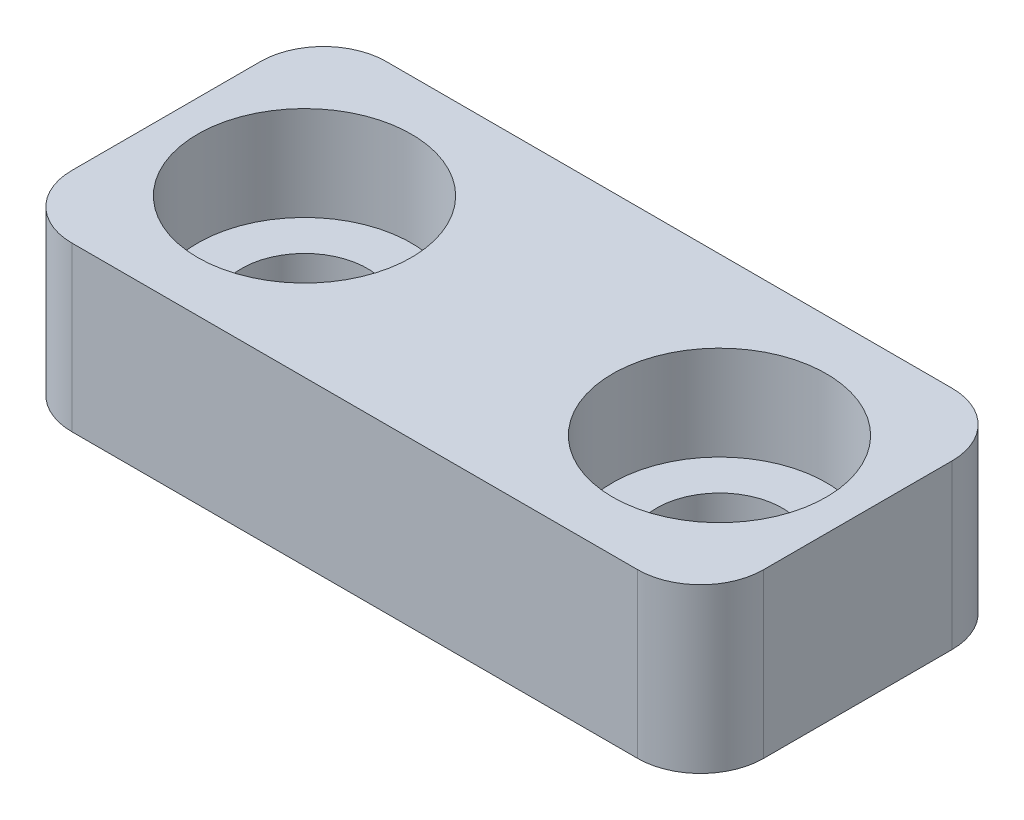
ISO-10303-21;
HEADER;
FILE_DESCRIPTION(('STEP AP214'),'2;1');
FILE_NAME('part.step','',(''),(''),'','','');
FILE_SCHEMA(('AUTOMOTIVE_DESIGN { 1 0 10303 214 1 1 1 1 }'));
ENDSEC;
DATA;
#1=APPLICATION_CONTEXT('core data for automotive mechanical design processes');
#2=APPLICATION_PROTOCOL_DEFINITION('international standard','automotive_design',2000,#1);
#3=PRODUCT_CONTEXT('',#1,'mechanical');
#4=PRODUCT('Part','Part','',(#3));
#5=PRODUCT_RELATED_PRODUCT_CATEGORY('part','',(#4));
#6=PRODUCT_DEFINITION_FORMATION('','',#4);
#7=PRODUCT_DEFINITION_CONTEXT('part definition',#1,'design');
#8=PRODUCT_DEFINITION('design','',#6,#7);
#9=PRODUCT_DEFINITION_SHAPE('','',#8);
#10=(LENGTH_UNIT() NAMED_UNIT(*) SI_UNIT(.MILLI.,.METRE.));
#11=(NAMED_UNIT(*) PLANE_ANGLE_UNIT() SI_UNIT($,.RADIAN.));
#12=(NAMED_UNIT(*) SI_UNIT($,.STERADIAN.) SOLID_ANGLE_UNIT());
#13=UNCERTAINTY_MEASURE_WITH_UNIT(LENGTH_MEASURE(1.E-05),#10,'distance_accuracy_value','');
#14=(GEOMETRIC_REPRESENTATION_CONTEXT(3) GLOBAL_UNCERTAINTY_ASSIGNED_CONTEXT((#13)) GLOBAL_UNIT_ASSIGNED_CONTEXT((#10,
#11,#12)) REPRESENTATION_CONTEXT('',''));
#15=CARTESIAN_POINT('',(0.,0.,0.));
#16=DIRECTION('',(0.,0.,1.));
#17=DIRECTION('',(1.,0.,0.));
#18=AXIS2_PLACEMENT_3D('',#15,#16,#17);
#19=CARTESIAN_POINT('',(3.30000000000001,2.6,0.));
#20=DIRECTION('',(0.,-1.,0.));
#21=DIRECTION('',(0.,0.,-1.));
#22=AXIS2_PLACEMENT_3D('',#19,#20,#21);
#23=CYLINDRICAL_SURFACE('',#22,0.999999999999999);
#24=CARTESIAN_POINT('',(3.30000000000001,0.,0.));
#25=DIRECTION('',(0.,1.,0.));
#26=DIRECTION('',(0.,0.,1.));
#27=AXIS2_PLACEMENT_3D('',#24,#25,#26);
#28=CIRCLE('',#27,0.999999999999999);
#29=CARTESIAN_POINT('',(3.30000000000001,0.,0.999999999999999));
#30=VERTEX_POINT('',#29);
#31=EDGE_CURVE('E137',#30,#30,#28,.T.);
#32=ORIENTED_EDGE('',*,*,#31,.F.);
#33=EDGE_LOOP('',(#32));
#34=FACE_BOUND('',#33,.T.);
#35=CARTESIAN_POINT('',(3.30000000000001,1.1,0.));
#36=DIRECTION('',(0.,1.,0.));
#37=DIRECTION('',(0.,0.,1.));
#38=AXIS2_PLACEMENT_3D('',#35,#36,#37);
#39=CIRCLE('',#38,0.999999999999999);
#40=CARTESIAN_POINT('',(3.30000000000001,1.1,0.999999999999999));
#41=VERTEX_POINT('',#40);
#42=EDGE_CURVE('E150',#41,#41,#39,.T.);
#43=ORIENTED_EDGE('',*,*,#42,.T.);
#44=EDGE_LOOP('',(#43));
#45=FACE_BOUND('',#44,.T.);
#46=ADVANCED_FACE('F37',(#34,#45),#23,.F.);
#47=CARTESIAN_POINT('',(-3.29999999999999,2.6,0.));
#48=DIRECTION('',(0.,-1.,0.));
#49=DIRECTION('',(0.,0.,-1.));
#50=AXIS2_PLACEMENT_3D('',#47,#48,#49);
#51=CYLINDRICAL_SURFACE('',#50,1.);
#52=CARTESIAN_POINT('',(-3.29999999999999,0.,0.));
#53=DIRECTION('',(0.,1.,0.));
#54=DIRECTION('',(0.,0.,1.));
#55=AXIS2_PLACEMENT_3D('',#52,#53,#54);
#56=CIRCLE('',#55,1.);
#57=CARTESIAN_POINT('',(-3.29999999999999,0.,1.));
#58=VERTEX_POINT('',#57);
#59=EDGE_CURVE('E131',#58,#58,#56,.T.);
#60=ORIENTED_EDGE('',*,*,#59,.F.);
#61=EDGE_LOOP('',(#60));
#62=FACE_BOUND('',#61,.T.);
#63=CARTESIAN_POINT('',(-3.29999999999999,1.1,0.));
#64=DIRECTION('',(0.,1.,0.));
#65=DIRECTION('',(0.,0.,1.));
#66=AXIS2_PLACEMENT_3D('',#63,#64,#65);
#67=CIRCLE('',#66,1.);
#68=CARTESIAN_POINT('',(-3.29999999999999,1.1,1.));
#69=VERTEX_POINT('',#68);
#70=EDGE_CURVE('E146',#69,#69,#67,.T.);
#71=ORIENTED_EDGE('',*,*,#70,.T.);
#72=EDGE_LOOP('',(#71));
#73=FACE_BOUND('',#72,.T.);
#74=ADVANCED_FACE('F217',(#62,#73),#51,.F.);
#75=CARTESIAN_POINT('',(0.,2.6,0.));
#76=DIRECTION('',(0.,-1.,0.));
#77=DIRECTION('',(0.,0.,-1.));
#78=AXIS2_PLACEMENT_3D('',#75,#76,#77);
#79=PLANE('',#78);
#80=CARTESIAN_POINT('',(3.30000000000001,2.6,0.));
#81=DIRECTION('',(0.,1.,0.));
#82=DIRECTION('',(0.,0.,1.));
#83=AXIS2_PLACEMENT_3D('',#80,#81,#82);
#84=CIRCLE('',#83,1.7);
#85=CARTESIAN_POINT('',(3.30000000000001,2.6,1.7));
#86=VERTEX_POINT('',#85);
#87=EDGE_CURVE('E199',#86,#86,#84,.T.);
#88=ORIENTED_EDGE('',*,*,#87,.F.);
#89=EDGE_LOOP('',(#88));
#90=FACE_BOUND('',#89,.T.);
#91=CARTESIAN_POINT('',(-3.29999999999999,2.6,0.));
#92=DIRECTION('',(0.,1.,0.));
#93=DIRECTION('',(0.,0.,1.));
#94=AXIS2_PLACEMENT_3D('',#91,#92,#93);
#95=CIRCLE('',#94,1.7);
#96=CARTESIAN_POINT('',(-3.29999999999999,2.6,1.7));
#97=VERTEX_POINT('',#96);
#98=EDGE_CURVE('E153',#97,#97,#95,.T.);
#99=ORIENTED_EDGE('',*,*,#98,.F.);
#100=EDGE_LOOP('',(#99));
#101=FACE_BOUND('',#100,.T.);
#102=DIRECTION('',(1.,0.,0.));
#103=VECTOR('',#102,1.);
#104=CARTESIAN_POINT('',(-5.49999999999999,2.6,2.50000000000001));
#105=LINE('',#104,#103);
#106=CARTESIAN_POINT('',(-4.49999999999999,2.6,2.50000000000001));
#107=VERTEX_POINT('',#106);
#108=CARTESIAN_POINT('',(4.50000000000001,2.6,2.50000000000001));
#109=VERTEX_POINT('',#108);
#110=EDGE_CURVE('E140',#107,#109,#105,.T.);
#111=ORIENTED_EDGE('',*,*,#110,.T.);
#112=CARTESIAN_POINT('',(4.50000000000001,2.6,1.50000000000001));
#113=DIRECTION('',(0.,-1.,0.));
#114=DIRECTION('',(0.,0.,-1.));
#115=AXIS2_PLACEMENT_3D('',#112,#113,#114);
#116=CIRCLE('',#115,1.);
#117=CARTESIAN_POINT('',(5.50000000000001,2.6,1.50000000000001));
#118=VERTEX_POINT('',#117);
#119=EDGE_CURVE('E168',#109,#118,#116,.F.);
#120=ORIENTED_EDGE('',*,*,#119,.T.);
#121=DIRECTION('',(0.,0.,-1.));
#122=VECTOR('',#121,1.);
#123=CARTESIAN_POINT('',(5.50000000000001,2.6,2.50000000000001));
#124=LINE('',#123,#122);
#125=CARTESIAN_POINT('',(5.50000000000001,2.6,-1.5));
#126=VERTEX_POINT('',#125);
#127=EDGE_CURVE('E123',#118,#126,#124,.T.);
#128=ORIENTED_EDGE('',*,*,#127,.T.);
#129=CARTESIAN_POINT('',(4.50000000000001,2.6,-1.5));
#130=DIRECTION('',(0.,-1.,0.));
#131=DIRECTION('',(0.,0.,-1.));
#132=AXIS2_PLACEMENT_3D('',#129,#130,#131);
#133=CIRCLE('',#132,1.);
#134=CARTESIAN_POINT('',(4.50000000000001,2.6,-2.5));
#135=VERTEX_POINT('',#134);
#136=EDGE_CURVE('E166',#126,#135,#133,.F.);
#137=ORIENTED_EDGE('',*,*,#136,.T.);
#138=DIRECTION('',(-1.,0.,0.));
#139=VECTOR('',#138,1.);
#140=CARTESIAN_POINT('',(-5.49999999999999,2.6,-2.5));
#141=LINE('',#140,#139);
#142=CARTESIAN_POINT('',(-4.49999999999999,2.6,-2.5));
#143=VERTEX_POINT('',#142);
#144=EDGE_CURVE('E179',#135,#143,#141,.T.);
#145=ORIENTED_EDGE('',*,*,#144,.T.);
#146=CARTESIAN_POINT('',(-4.49999999999999,2.6,-1.5));
#147=DIRECTION('',(0.,-1.,0.));
#148=DIRECTION('',(0.,0.,-1.));
#149=AXIS2_PLACEMENT_3D('',#146,#147,#148);
#150=CIRCLE('',#149,1.);
#151=CARTESIAN_POINT('',(-5.49999999999999,2.6,-1.5));
#152=VERTEX_POINT('',#151);
#153=EDGE_CURVE('E58',#143,#152,#150,.F.);
#154=ORIENTED_EDGE('',*,*,#153,.T.);
#155=DIRECTION('',(0.,0.,1.));
#156=VECTOR('',#155,1.);
#157=CARTESIAN_POINT('',(-5.49999999999999,2.6,2.50000000000001));
#158=LINE('',#157,#156);
#159=CARTESIAN_POINT('',(-5.49999999999999,2.6,1.50000000000001));
#160=VERTEX_POINT('',#159);
#161=EDGE_CURVE('E187',#152,#160,#158,.T.);
#162=ORIENTED_EDGE('',*,*,#161,.T.);
#163=CARTESIAN_POINT('',(-4.49999999999999,2.6,1.50000000000001));
#164=DIRECTION('',(0.,-1.,0.));
#165=DIRECTION('',(0.,0.,-1.));
#166=AXIS2_PLACEMENT_3D('',#163,#164,#165);
#167=CIRCLE('',#166,1.);
#168=EDGE_CURVE('E163',#160,#107,#167,.F.);
#169=ORIENTED_EDGE('',*,*,#168,.T.);
#170=EDGE_LOOP('',(#111,#120,#128,#137,#145,#154,#162,#169));
#171=FACE_BOUND('',#170,.T.);
#172=ADVANCED_FACE('F214',(#90,#101,#171),#79,.F.);
#173=CARTESIAN_POINT('',(0.,0.,0.));
#174=DIRECTION('',(0.,-1.,0.));
#175=DIRECTION('',(0.,0.,-1.));
#176=AXIS2_PLACEMENT_3D('',#173,#174,#175);
#177=PLANE('',#176);
#178=ORIENTED_EDGE('',*,*,#59,.T.);
#179=EDGE_LOOP('',(#178));
#180=FACE_BOUND('',#179,.T.);
#181=DIRECTION('',(0.,0.,-1.));
#182=VECTOR('',#181,1.);
#183=CARTESIAN_POINT('',(5.50000000000001,0.,2.50000000000001));
#184=LINE('',#183,#182);
#185=CARTESIAN_POINT('',(5.50000000000001,0.,1.50000000000001));
#186=VERTEX_POINT('',#185);
#187=CARTESIAN_POINT('',(5.50000000000001,0.,-1.5));
#188=VERTEX_POINT('',#187);
#189=EDGE_CURVE('E120',#186,#188,#184,.T.);
#190=ORIENTED_EDGE('',*,*,#189,.F.);
#191=CARTESIAN_POINT('',(4.50000000000001,0.,1.50000000000001));
#192=DIRECTION('',(0.,-1.,0.));
#193=DIRECTION('',(0.,0.,-1.));
#194=AXIS2_PLACEMENT_3D('',#191,#192,#193);
#195=CIRCLE('',#194,1.);
#196=CARTESIAN_POINT('',(4.50000000000001,0.,2.50000000000001));
#197=VERTEX_POINT('',#196);
#198=EDGE_CURVE('E103',#186,#197,#195,.T.);
#199=ORIENTED_EDGE('',*,*,#198,.T.);
#200=DIRECTION('',(1.,0.,0.));
#201=VECTOR('',#200,1.);
#202=CARTESIAN_POINT('',(-5.49999999999999,0.,2.50000000000001));
#203=LINE('',#202,#201);
#204=CARTESIAN_POINT('',(-4.49999999999999,0.,2.50000000000001));
#205=VERTEX_POINT('',#204);
#206=EDGE_CURVE('E144',#205,#197,#203,.T.);
#207=ORIENTED_EDGE('',*,*,#206,.F.);
#208=CARTESIAN_POINT('',(-4.49999999999999,0.,1.50000000000001));
#209=DIRECTION('',(0.,-1.,0.));
#210=DIRECTION('',(0.,0.,-1.));
#211=AXIS2_PLACEMENT_3D('',#208,#209,#210);
#212=CIRCLE('',#211,1.);
#213=CARTESIAN_POINT('',(-5.49999999999999,0.,1.50000000000001));
#214=VERTEX_POINT('',#213);
#215=EDGE_CURVE('E124',#205,#214,#212,.T.);
#216=ORIENTED_EDGE('',*,*,#215,.T.);
#217=DIRECTION('',(0.,0.,1.));
#218=VECTOR('',#217,1.);
#219=CARTESIAN_POINT('',(-5.49999999999999,0.,2.50000000000001));
#220=LINE('',#219,#218);
#221=CARTESIAN_POINT('',(-5.49999999999999,0.,-1.5));
#222=VERTEX_POINT('',#221);
#223=EDGE_CURVE('E134',#222,#214,#220,.T.);
#224=ORIENTED_EDGE('',*,*,#223,.F.);
#225=CARTESIAN_POINT('',(-4.49999999999999,0.,-1.5));
#226=DIRECTION('',(0.,-1.,0.));
#227=DIRECTION('',(0.,0.,-1.));
#228=AXIS2_PLACEMENT_3D('',#225,#226,#227);
#229=CIRCLE('',#228,1.);
#230=CARTESIAN_POINT('',(-4.49999999999999,0.,-2.5));
#231=VERTEX_POINT('',#230);
#232=EDGE_CURVE('E157',#222,#231,#229,.T.);
#233=ORIENTED_EDGE('',*,*,#232,.T.);
#234=DIRECTION('',(-1.,0.,0.));
#235=VECTOR('',#234,1.);
#236=CARTESIAN_POINT('',(-5.49999999999999,0.,-2.5));
#237=LINE('',#236,#235);
#238=CARTESIAN_POINT('',(4.50000000000001,0.,-2.5));
#239=VERTEX_POINT('',#238);
#240=EDGE_CURVE('E130',#239,#231,#237,.T.);
#241=ORIENTED_EDGE('',*,*,#240,.F.);
#242=CARTESIAN_POINT('',(4.50000000000001,0.,-1.5));
#243=DIRECTION('',(0.,-1.,0.));
#244=DIRECTION('',(0.,0.,-1.));
#245=AXIS2_PLACEMENT_3D('',#242,#243,#244);
#246=CIRCLE('',#245,1.);
#247=EDGE_CURVE('E114',#239,#188,#246,.T.);
#248=ORIENTED_EDGE('',*,*,#247,.T.);
#249=EDGE_LOOP('',(#190,#199,#207,#216,#224,#233,#241,#248));
#250=FACE_BOUND('',#249,.T.);
#251=ORIENTED_EDGE('',*,*,#31,.T.);
#252=EDGE_LOOP('',(#251));
#253=FACE_BOUND('',#252,.T.);
#254=ADVANCED_FACE('F127',(#180,#250,#253),#177,.T.);
#255=CARTESIAN_POINT('',(5.50000000000001,2.6,2.50000000000001));
#256=DIRECTION('',(-1.,0.,0.));
#257=DIRECTION('',(0.,0.,1.));
#258=AXIS2_PLACEMENT_3D('',#255,#256,#257);
#259=PLANE('',#258);
#260=ORIENTED_EDGE('',*,*,#127,.F.);
#261=DIRECTION('',(0.,-1.,0.));
#262=VECTOR('',#261,1.);
#263=CARTESIAN_POINT('',(5.50000000000001,2.6,1.50000000000001));
#264=LINE('',#263,#262);
#265=EDGE_CURVE('E107',#118,#186,#264,.T.);
#266=ORIENTED_EDGE('',*,*,#265,.T.);
#267=ORIENTED_EDGE('',*,*,#189,.T.);
#268=DIRECTION('',(0.,-1.,0.));
#269=VECTOR('',#268,1.);
#270=CARTESIAN_POINT('',(5.50000000000001,2.6,-1.5));
#271=LINE('',#270,#269);
#272=EDGE_CURVE('E125',#188,#126,#271,.F.);
#273=ORIENTED_EDGE('',*,*,#272,.T.);
#274=EDGE_LOOP('',(#260,#266,#267,#273));
#275=FACE_BOUND('',#274,.T.);
#276=ADVANCED_FACE('F119',(#275),#259,.F.);
#277=CARTESIAN_POINT('',(-5.49999999999999,2.6,-2.5));
#278=DIRECTION('',(0.,0.,1.));
#279=DIRECTION('',(1.,0.,0.));
#280=AXIS2_PLACEMENT_3D('',#277,#278,#279);
#281=PLANE('',#280);
#282=ORIENTED_EDGE('',*,*,#144,.F.);
#283=DIRECTION('',(0.,-1.,0.));
#284=VECTOR('',#283,1.);
#285=CARTESIAN_POINT('',(4.50000000000001,2.6,-2.5));
#286=LINE('',#285,#284);
#287=EDGE_CURVE('E172',#135,#239,#286,.T.);
#288=ORIENTED_EDGE('',*,*,#287,.T.);
#289=ORIENTED_EDGE('',*,*,#240,.T.);
#290=DIRECTION('',(0.,-1.,0.));
#291=VECTOR('',#290,1.);
#292=CARTESIAN_POINT('',(-4.49999999999999,2.6,-2.5));
#293=LINE('',#292,#291);
#294=EDGE_CURVE('E170',#231,#143,#293,.F.);
#295=ORIENTED_EDGE('',*,*,#294,.T.);
#296=EDGE_LOOP('',(#282,#288,#289,#295));
#297=FACE_BOUND('',#296,.T.);
#298=ADVANCED_FACE('F177',(#297),#281,.F.);
#299=CARTESIAN_POINT('',(-5.49999999999999,2.6,2.50000000000001));
#300=DIRECTION('',(1.,0.,0.));
#301=DIRECTION('',(0.,0.,-1.));
#302=AXIS2_PLACEMENT_3D('',#299,#300,#301);
#303=PLANE('',#302);
#304=ORIENTED_EDGE('',*,*,#161,.F.);
#305=DIRECTION('',(0.,-1.,0.));
#306=VECTOR('',#305,1.);
#307=CARTESIAN_POINT('',(-5.49999999999999,2.6,-1.5));
#308=LINE('',#307,#306);
#309=EDGE_CURVE('E11',#152,#222,#308,.T.);
#310=ORIENTED_EDGE('',*,*,#309,.T.);
#311=ORIENTED_EDGE('',*,*,#223,.T.);
#312=DIRECTION('',(0.,-1.,0.));
#313=VECTOR('',#312,1.);
#314=CARTESIAN_POINT('',(-5.49999999999999,2.6,1.50000000000001));
#315=LINE('',#314,#313);
#316=EDGE_CURVE('E45',#214,#160,#315,.F.);
#317=ORIENTED_EDGE('',*,*,#316,.T.);
#318=EDGE_LOOP('',(#304,#310,#311,#317));
#319=FACE_BOUND('',#318,.T.);
#320=ADVANCED_FACE('F186',(#319),#303,.F.);
#321=CARTESIAN_POINT('',(-5.49999999999999,2.6,2.50000000000001));
#322=DIRECTION('',(0.,0.,-1.));
#323=DIRECTION('',(-1.,0.,0.));
#324=AXIS2_PLACEMENT_3D('',#321,#322,#323);
#325=PLANE('',#324);
#326=ORIENTED_EDGE('',*,*,#206,.T.);
#327=DIRECTION('',(0.,-1.,0.));
#328=VECTOR('',#327,1.);
#329=CARTESIAN_POINT('',(4.50000000000001,2.6,2.50000000000001));
#330=LINE('',#329,#328);
#331=EDGE_CURVE('E108',#197,#109,#330,.F.);
#332=ORIENTED_EDGE('',*,*,#331,.T.);
#333=ORIENTED_EDGE('',*,*,#110,.F.);
#334=DIRECTION('',(0.,-1.,0.));
#335=VECTOR('',#334,1.);
#336=CARTESIAN_POINT('',(-4.49999999999999,2.6,2.50000000000001));
#337=LINE('',#336,#335);
#338=EDGE_CURVE('E113',#107,#205,#337,.T.);
#339=ORIENTED_EDGE('',*,*,#338,.T.);
#340=EDGE_LOOP('',(#326,#332,#333,#339));
#341=FACE_BOUND('',#340,.T.);
#342=ADVANCED_FACE('F223',(#341),#325,.F.);
#343=CARTESIAN_POINT('',(-3.29999999999999,1.1,0.));
#344=DIRECTION('',(0.,1.,0.));
#345=DIRECTION('',(0.,0.,1.));
#346=AXIS2_PLACEMENT_3D('',#343,#344,#345);
#347=CYLINDRICAL_SURFACE('',#346,1.7);
#348=CARTESIAN_POINT('',(-3.29999999999999,1.1,0.));
#349=DIRECTION('',(0.,1.,0.));
#350=DIRECTION('',(0.,0.,1.));
#351=AXIS2_PLACEMENT_3D('',#348,#349,#350);
#352=CIRCLE('',#351,1.7);
#353=CARTESIAN_POINT('',(-3.29999999999999,1.1,1.7));
#354=VERTEX_POINT('',#353);
#355=EDGE_CURVE('E149',#354,#354,#352,.T.);
#356=ORIENTED_EDGE('',*,*,#355,.F.);
#357=EDGE_LOOP('',(#356));
#358=FACE_BOUND('',#357,.T.);
#359=ORIENTED_EDGE('',*,*,#98,.T.);
#360=EDGE_LOOP('',(#359));
#361=FACE_BOUND('',#360,.T.);
#362=ADVANCED_FACE('F241',(#358,#361),#347,.F.);
#363=CARTESIAN_POINT('',(-3.29999999999999,1.1,0.));
#364=DIRECTION('',(0.,1.,0.));
#365=DIRECTION('',(0.,0.,1.));
#366=AXIS2_PLACEMENT_3D('',#363,#364,#365);
#367=PLANE('',#366);
#368=ORIENTED_EDGE('',*,*,#70,.F.);
#369=EDGE_LOOP('',(#368));
#370=FACE_BOUND('',#369,.T.);
#371=ORIENTED_EDGE('',*,*,#355,.T.);
#372=EDGE_LOOP('',(#371));
#373=FACE_BOUND('',#372,.T.);
#374=ADVANCED_FACE('F210',(#370,#373),#367,.T.);
#375=CARTESIAN_POINT('',(3.30000000000001,1.1,0.));
#376=DIRECTION('',(0.,1.,0.));
#377=DIRECTION('',(0.,0.,1.));
#378=AXIS2_PLACEMENT_3D('',#375,#376,#377);
#379=CYLINDRICAL_SURFACE('',#378,1.7);
#380=CARTESIAN_POINT('',(3.30000000000001,1.1,0.));
#381=DIRECTION('',(0.,1.,0.));
#382=DIRECTION('',(0.,0.,1.));
#383=AXIS2_PLACEMENT_3D('',#380,#381,#382);
#384=CIRCLE('',#383,1.7);
#385=CARTESIAN_POINT('',(3.30000000000001,1.1,1.7));
#386=VERTEX_POINT('',#385);
#387=EDGE_CURVE('E154',#386,#386,#384,.T.);
#388=ORIENTED_EDGE('',*,*,#387,.F.);
#389=EDGE_LOOP('',(#388));
#390=FACE_BOUND('',#389,.T.);
#391=ORIENTED_EDGE('',*,*,#87,.T.);
#392=EDGE_LOOP('',(#391));
#393=FACE_BOUND('',#392,.T.);
#394=ADVANCED_FACE('F207',(#390,#393),#379,.F.);
#395=CARTESIAN_POINT('',(3.30000000000001,1.1,0.));
#396=DIRECTION('',(0.,1.,0.));
#397=DIRECTION('',(0.,0.,1.));
#398=AXIS2_PLACEMENT_3D('',#395,#396,#397);
#399=PLANE('',#398);
#400=ORIENTED_EDGE('',*,*,#42,.F.);
#401=EDGE_LOOP('',(#400));
#402=FACE_BOUND('',#401,.T.);
#403=ORIENTED_EDGE('',*,*,#387,.T.);
#404=EDGE_LOOP('',(#403));
#405=FACE_BOUND('',#404,.T.);
#406=ADVANCED_FACE('F205',(#402,#405),#399,.T.);
#407=CARTESIAN_POINT('',(4.50000000000001,2.6,1.50000000000001));
#408=DIRECTION('',(0.,-1.,0.));
#409=DIRECTION('',(0.,0.,-1.));
#410=AXIS2_PLACEMENT_3D('',#407,#408,#409);
#411=CYLINDRICAL_SURFACE('',#410,1.);
#412=ORIENTED_EDGE('',*,*,#119,.F.);
#413=ORIENTED_EDGE('',*,*,#331,.F.);
#414=ORIENTED_EDGE('',*,*,#198,.F.);
#415=ORIENTED_EDGE('',*,*,#265,.F.);
#416=EDGE_LOOP('',(#412,#413,#414,#415));
#417=FACE_BOUND('',#416,.T.);
#418=ADVANCED_FACE('F106',(#417),#411,.T.);
#419=CARTESIAN_POINT('',(4.50000000000001,2.6,-1.5));
#420=DIRECTION('',(0.,-1.,0.));
#421=DIRECTION('',(0.,0.,-1.));
#422=AXIS2_PLACEMENT_3D('',#419,#420,#421);
#423=CYLINDRICAL_SURFACE('',#422,1.);
#424=ORIENTED_EDGE('',*,*,#136,.F.);
#425=ORIENTED_EDGE('',*,*,#272,.F.);
#426=ORIENTED_EDGE('',*,*,#247,.F.);
#427=ORIENTED_EDGE('',*,*,#287,.F.);
#428=EDGE_LOOP('',(#424,#425,#426,#427));
#429=FACE_BOUND('',#428,.T.);
#430=ADVANCED_FACE('F229',(#429),#423,.T.);
#431=CARTESIAN_POINT('',(-4.49999999999999,2.6,-1.5));
#432=DIRECTION('',(0.,-1.,0.));
#433=DIRECTION('',(0.,0.,-1.));
#434=AXIS2_PLACEMENT_3D('',#431,#432,#433);
#435=CYLINDRICAL_SURFACE('',#434,1.);
#436=ORIENTED_EDGE('',*,*,#153,.F.);
#437=ORIENTED_EDGE('',*,*,#294,.F.);
#438=ORIENTED_EDGE('',*,*,#232,.F.);
#439=ORIENTED_EDGE('',*,*,#309,.F.);
#440=EDGE_LOOP('',(#436,#437,#438,#439));
#441=FACE_BOUND('',#440,.T.);
#442=ADVANCED_FACE('F185',(#441),#435,.T.);
#443=CARTESIAN_POINT('',(-4.49999999999999,2.6,1.50000000000001));
#444=DIRECTION('',(0.,-1.,0.));
#445=DIRECTION('',(0.,0.,-1.));
#446=AXIS2_PLACEMENT_3D('',#443,#444,#445);
#447=CYLINDRICAL_SURFACE('',#446,1.);
#448=ORIENTED_EDGE('',*,*,#168,.F.);
#449=ORIENTED_EDGE('',*,*,#316,.F.);
#450=ORIENTED_EDGE('',*,*,#215,.F.);
#451=ORIENTED_EDGE('',*,*,#338,.F.);
#452=EDGE_LOOP('',(#448,#449,#450,#451));
#453=FACE_BOUND('',#452,.T.);
#454=ADVANCED_FACE('F39',(#453),#447,.T.);
#455=CLOSED_SHELL('',(#46,#74,#172,#254,#276,#298,#320,#342,#362,#374,#394,#406,#418,#430,#442,#454));
#456=MANIFOLD_SOLID_BREP('B2',#455);
#457=ADVANCED_BREP_SHAPE_REPRESENTATION('',(#18,#456),#14);
#458=SHAPE_DEFINITION_REPRESENTATION(#9,#457);
ENDSEC;
END-ISO-10303-21;
